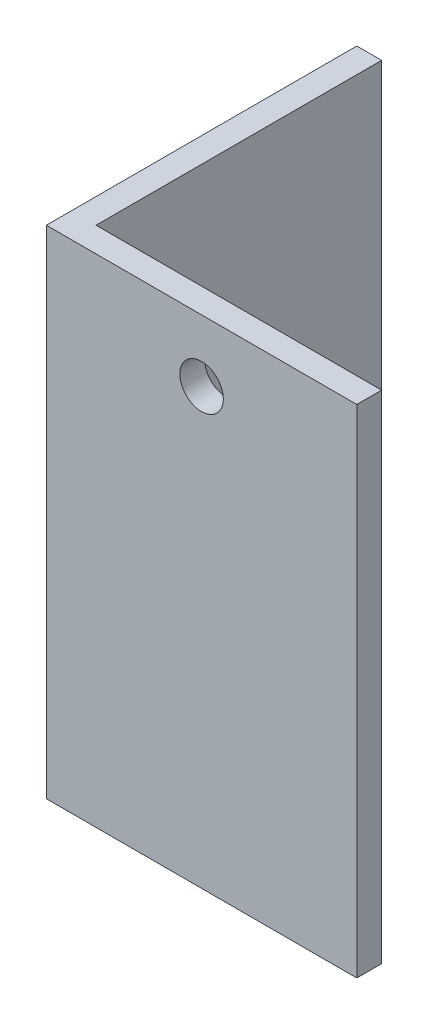
ISO-10303-21;
HEADER;
FILE_DESCRIPTION(('STEP AP214'),'2;1');
FILE_NAME('part.step','',(''),(''),'','','');
FILE_SCHEMA(('AUTOMOTIVE_DESIGN { 1 0 10303 214 1 1 1 1 }'));
ENDSEC;
DATA;
#1=APPLICATION_CONTEXT('core data for automotive mechanical design processes');
#2=APPLICATION_PROTOCOL_DEFINITION('international standard','automotive_design',2000,#1);
#3=PRODUCT_CONTEXT('',#1,'mechanical');
#4=PRODUCT('Part','Part','',(#3));
#5=PRODUCT_RELATED_PRODUCT_CATEGORY('part','',(#4));
#6=PRODUCT_DEFINITION_FORMATION('','',#4);
#7=PRODUCT_DEFINITION_CONTEXT('part definition',#1,'design');
#8=PRODUCT_DEFINITION('design','',#6,#7);
#9=PRODUCT_DEFINITION_SHAPE('','',#8);
#10=(LENGTH_UNIT() NAMED_UNIT(*) SI_UNIT(.MILLI.,.METRE.));
#11=(NAMED_UNIT(*) PLANE_ANGLE_UNIT() SI_UNIT($,.RADIAN.));
#12=(NAMED_UNIT(*) SI_UNIT($,.STERADIAN.) SOLID_ANGLE_UNIT());
#13=UNCERTAINTY_MEASURE_WITH_UNIT(LENGTH_MEASURE(1.E-05),#10,'distance_accuracy_value','');
#14=(GEOMETRIC_REPRESENTATION_CONTEXT(3) GLOBAL_UNCERTAINTY_ASSIGNED_CONTEXT((#13)) GLOBAL_UNIT_ASSIGNED_CONTEXT((#10,
#11,#12)) REPRESENTATION_CONTEXT('',''));
#15=CARTESIAN_POINT('',(0.,0.,0.));
#16=DIRECTION('',(0.,0.,1.));
#17=DIRECTION('',(1.,0.,0.));
#18=AXIS2_PLACEMENT_3D('',#15,#16,#17);
#19=CARTESIAN_POINT('',(0.,40.,0.));
#20=DIRECTION('',(1.,0.,0.));
#21=DIRECTION('',(0.,0.,-1.));
#22=AXIS2_PLACEMENT_3D('',#19,#20,#21);
#23=PLANE('',#22);
#24=CARTESIAN_POINT('',(0.,5.,-10.));
#25=DIRECTION('',(1.,0.,0.));
#26=DIRECTION('',(0.,0.,-1.));
#27=AXIS2_PLACEMENT_3D('',#24,#25,#26);
#28=CIRCLE('',#27,1.75);
#29=CARTESIAN_POINT('',(0.,5.,-11.75));
#30=VERTEX_POINT('',#29);
#31=EDGE_CURVE('E137',#30,#30,#28,.T.);
#32=ORIENTED_EDGE('',*,*,#31,.T.);
#33=EDGE_LOOP('',(#32));
#34=FACE_BOUND('',#33,.T.);
#35=DIRECTION('',(0.,0.,1.));
#36=VECTOR('',#35,1.);
#37=CARTESIAN_POINT('',(0.,0.,0.));
#38=LINE('',#37,#36);
#39=CARTESIAN_POINT('',(0.,0.,-25.));
#40=VERTEX_POINT('',#39);
#41=CARTESIAN_POINT('',(0.,0.,0.));
#42=VERTEX_POINT('',#41);
#43=EDGE_CURVE('E120',#40,#42,#38,.T.);
#44=ORIENTED_EDGE('',*,*,#43,.T.);
#45=DIRECTION('',(0.,-1.,0.));
#46=VECTOR('',#45,1.);
#47=CARTESIAN_POINT('',(0.,40.,0.));
#48=LINE('',#47,#46);
#49=CARTESIAN_POINT('',(0.,40.,0.));
#50=VERTEX_POINT('',#49);
#51=EDGE_CURVE('E11',#50,#42,#48,.T.);
#52=ORIENTED_EDGE('',*,*,#51,.F.);
#53=DIRECTION('',(0.,0.,1.));
#54=VECTOR('',#53,1.);
#55=CARTESIAN_POINT('',(0.,40.,0.));
#56=LINE('',#55,#54);
#57=CARTESIAN_POINT('',(0.,40.,-25.));
#58=VERTEX_POINT('',#57);
#59=EDGE_CURVE('E131',#58,#50,#56,.T.);
#60=ORIENTED_EDGE('',*,*,#59,.F.);
#61=DIRECTION('',(0.,-1.,0.));
#62=VECTOR('',#61,1.);
#63=CARTESIAN_POINT('',(0.,40.,-25.));
#64=LINE('',#63,#62);
#65=EDGE_CURVE('E116',#58,#40,#64,.T.);
#66=ORIENTED_EDGE('',*,*,#65,.T.);
#67=EDGE_LOOP('',(#44,#52,#60,#66));
#68=FACE_BOUND('',#67,.T.);
#69=ADVANCED_FACE('F34',(#34,#68),#23,.F.);
#70=CARTESIAN_POINT('',(0.,40.,0.));
#71=DIRECTION('',(0.,0.,-1.));
#72=DIRECTION('',(-1.,0.,0.));
#73=AXIS2_PLACEMENT_3D('',#70,#71,#72);
#74=PLANE('',#73);
#75=CARTESIAN_POINT('',(12.5,35.,0.));
#76=DIRECTION('',(0.,0.,-1.));
#77=DIRECTION('',(-1.,0.,0.));
#78=AXIS2_PLACEMENT_3D('',#75,#76,#77);
#79=CIRCLE('',#78,1.75);
#80=CARTESIAN_POINT('',(10.75,35.,0.));
#81=VERTEX_POINT('',#80);
#82=EDGE_CURVE('E145',#81,#81,#79,.T.);
#83=ORIENTED_EDGE('',*,*,#82,.T.);
#84=EDGE_LOOP('',(#83));
#85=FACE_BOUND('',#84,.T.);
#86=DIRECTION('',(1.,0.,0.));
#87=VECTOR('',#86,1.);
#88=CARTESIAN_POINT('',(0.,0.,0.));
#89=LINE('',#88,#87);
#90=CARTESIAN_POINT('',(25.,0.,0.));
#91=VERTEX_POINT('',#90);
#92=EDGE_CURVE('E123',#42,#91,#89,.T.);
#93=ORIENTED_EDGE('',*,*,#92,.T.);
#94=DIRECTION('',(0.,-1.,0.));
#95=VECTOR('',#94,1.);
#96=CARTESIAN_POINT('',(25.,40.,0.));
#97=LINE('',#96,#95);
#98=CARTESIAN_POINT('',(25.,40.,0.));
#99=VERTEX_POINT('',#98);
#100=EDGE_CURVE('E43',#99,#91,#97,.T.);
#101=ORIENTED_EDGE('',*,*,#100,.F.);
#102=DIRECTION('',(1.,0.,0.));
#103=VECTOR('',#102,1.);
#104=CARTESIAN_POINT('',(0.,40.,0.));
#105=LINE('',#104,#103);
#106=EDGE_CURVE('E89',#50,#99,#105,.T.);
#107=ORIENTED_EDGE('',*,*,#106,.F.);
#108=ORIENTED_EDGE('',*,*,#51,.T.);
#109=EDGE_LOOP('',(#93,#101,#107,#108));
#110=FACE_BOUND('',#109,.T.);
#111=ADVANCED_FACE('F151',(#85,#110),#74,.F.);
#112=CARTESIAN_POINT('',(25.,40.,0.));
#113=DIRECTION('',(-1.,0.,0.));
#114=DIRECTION('',(0.,0.,1.));
#115=AXIS2_PLACEMENT_3D('',#112,#113,#114);
#116=PLANE('',#115);
#117=DIRECTION('',(0.,0.,-1.));
#118=VECTOR('',#117,1.);
#119=CARTESIAN_POINT('',(25.,0.,0.));
#120=LINE('',#119,#118);
#121=CARTESIAN_POINT('',(25.,0.,-2.));
#122=VERTEX_POINT('',#121);
#123=EDGE_CURVE('E126',#91,#122,#120,.T.);
#124=ORIENTED_EDGE('',*,*,#123,.T.);
#125=DIRECTION('',(0.,-1.,0.));
#126=VECTOR('',#125,1.);
#127=CARTESIAN_POINT('',(25.,40.,-2.));
#128=LINE('',#127,#126);
#129=CARTESIAN_POINT('',(25.,40.,-2.));
#130=VERTEX_POINT('',#129);
#131=EDGE_CURVE('E111',#130,#122,#128,.T.);
#132=ORIENTED_EDGE('',*,*,#131,.F.);
#133=DIRECTION('',(0.,0.,-1.));
#134=VECTOR('',#133,1.);
#135=CARTESIAN_POINT('',(25.,40.,0.));
#136=LINE('',#135,#134);
#137=EDGE_CURVE('E102',#99,#130,#136,.T.);
#138=ORIENTED_EDGE('',*,*,#137,.F.);
#139=ORIENTED_EDGE('',*,*,#100,.T.);
#140=EDGE_LOOP('',(#124,#132,#138,#139));
#141=FACE_BOUND('',#140,.T.);
#142=ADVANCED_FACE('F154',(#141),#116,.F.);
#143=CARTESIAN_POINT('',(25.,40.,-2.));
#144=DIRECTION('',(0.,0.,1.));
#145=DIRECTION('',(1.,0.,0.));
#146=AXIS2_PLACEMENT_3D('',#143,#144,#145);
#147=PLANE('',#146);
#148=CARTESIAN_POINT('',(12.5,35.,-2.));
#149=DIRECTION('',(0.,0.,1.));
#150=DIRECTION('',(1.,0.,0.));
#151=AXIS2_PLACEMENT_3D('',#148,#149,#150);
#152=CIRCLE('',#151,1.75);
#153=CARTESIAN_POINT('',(14.25,35.,-2.));
#154=VERTEX_POINT('',#153);
#155=EDGE_CURVE('E37',#154,#154,#152,.F.);
#156=ORIENTED_EDGE('',*,*,#155,.F.);
#157=EDGE_LOOP('',(#156));
#158=FACE_BOUND('',#157,.T.);
#159=DIRECTION('',(-1.,0.,0.));
#160=VECTOR('',#159,1.);
#161=CARTESIAN_POINT('',(25.,0.,-2.));
#162=LINE('',#161,#160);
#163=CARTESIAN_POINT('',(2.00000000000001,0.,-2.));
#164=VERTEX_POINT('',#163);
#165=EDGE_CURVE('E110',#122,#164,#162,.T.);
#166=ORIENTED_EDGE('',*,*,#165,.T.);
#167=DIRECTION('',(0.,-1.,0.));
#168=VECTOR('',#167,1.);
#169=CARTESIAN_POINT('',(2.00000000000001,40.,-2.));
#170=LINE('',#169,#168);
#171=CARTESIAN_POINT('',(2.00000000000001,40.,-2.));
#172=VERTEX_POINT('',#171);
#173=EDGE_CURVE('E107',#172,#164,#170,.T.);
#174=ORIENTED_EDGE('',*,*,#173,.F.);
#175=DIRECTION('',(-1.,0.,0.));
#176=VECTOR('',#175,1.);
#177=CARTESIAN_POINT('',(25.,40.,-2.));
#178=LINE('',#177,#176);
#179=EDGE_CURVE('E96',#130,#172,#178,.T.);
#180=ORIENTED_EDGE('',*,*,#179,.F.);
#181=ORIENTED_EDGE('',*,*,#131,.T.);
#182=EDGE_LOOP('',(#166,#174,#180,#181));
#183=FACE_BOUND('',#182,.T.);
#184=ADVANCED_FACE('F108',(#158,#183),#147,.F.);
#185=CARTESIAN_POINT('',(2.,40.,-25.));
#186=DIRECTION('',(-1.,0.,0.));
#187=DIRECTION('',(0.,0.,1.));
#188=AXIS2_PLACEMENT_3D('',#185,#186,#187);
#189=PLANE('',#188);
#190=CARTESIAN_POINT('',(2.,5.,-10.));
#191=DIRECTION('',(-1.,0.,0.));
#192=DIRECTION('',(0.,0.,1.));
#193=AXIS2_PLACEMENT_3D('',#190,#191,#192);
#194=CIRCLE('',#193,1.75);
#195=CARTESIAN_POINT('',(2.,5.,-8.25));
#196=VERTEX_POINT('',#195);
#197=EDGE_CURVE('E124',#196,#196,#194,.F.);
#198=ORIENTED_EDGE('',*,*,#197,.F.);
#199=EDGE_LOOP('',(#198));
#200=FACE_BOUND('',#199,.T.);
#201=DIRECTION('',(0.,0.,-1.));
#202=VECTOR('',#201,1.);
#203=CARTESIAN_POINT('',(2.,0.,-25.));
#204=LINE('',#203,#202);
#205=CARTESIAN_POINT('',(2.,0.,-25.));
#206=VERTEX_POINT('',#205);
#207=EDGE_CURVE('E75',#164,#206,#204,.T.);
#208=ORIENTED_EDGE('',*,*,#207,.T.);
#209=DIRECTION('',(0.,-1.,0.));
#210=VECTOR('',#209,1.);
#211=CARTESIAN_POINT('',(2.,40.,-25.));
#212=LINE('',#211,#210);
#213=CARTESIAN_POINT('',(2.,40.,-25.));
#214=VERTEX_POINT('',#213);
#215=EDGE_CURVE('E112',#214,#206,#212,.T.);
#216=ORIENTED_EDGE('',*,*,#215,.F.);
#217=DIRECTION('',(0.,0.,-1.));
#218=VECTOR('',#217,1.);
#219=CARTESIAN_POINT('',(2.,40.,-25.));
#220=LINE('',#219,#218);
#221=EDGE_CURVE('E100',#172,#214,#220,.T.);
#222=ORIENTED_EDGE('',*,*,#221,.F.);
#223=ORIENTED_EDGE('',*,*,#173,.T.);
#224=EDGE_LOOP('',(#208,#216,#222,#223));
#225=FACE_BOUND('',#224,.T.);
#226=ADVANCED_FACE('F114',(#200,#225),#189,.F.);
#227=CARTESIAN_POINT('',(0.,40.,-25.));
#228=DIRECTION('',(0.,0.,1.));
#229=DIRECTION('',(1.,0.,0.));
#230=AXIS2_PLACEMENT_3D('',#227,#228,#229);
#231=PLANE('',#230);
#232=DIRECTION('',(-1.,0.,0.));
#233=VECTOR('',#232,1.);
#234=CARTESIAN_POINT('',(0.,0.,-25.));
#235=LINE('',#234,#233);
#236=EDGE_CURVE('E81',#206,#40,#235,.T.);
#237=ORIENTED_EDGE('',*,*,#236,.T.);
#238=ORIENTED_EDGE('',*,*,#65,.F.);
#239=DIRECTION('',(-1.,0.,0.));
#240=VECTOR('',#239,1.);
#241=CARTESIAN_POINT('',(0.,40.,-25.));
#242=LINE('',#241,#240);
#243=EDGE_CURVE('E52',#214,#58,#242,.T.);
#244=ORIENTED_EDGE('',*,*,#243,.F.);
#245=ORIENTED_EDGE('',*,*,#215,.T.);
#246=EDGE_LOOP('',(#237,#238,#244,#245));
#247=FACE_BOUND('',#246,.T.);
#248=ADVANCED_FACE('F159',(#247),#231,.F.);
#249=CARTESIAN_POINT('',(0.,40.,0.));
#250=DIRECTION('',(0.,-1.,0.));
#251=DIRECTION('',(0.,0.,-1.));
#252=AXIS2_PLACEMENT_3D('',#249,#250,#251);
#253=PLANE('',#252);
#254=ORIENTED_EDGE('',*,*,#59,.T.);
#255=ORIENTED_EDGE('',*,*,#106,.T.);
#256=ORIENTED_EDGE('',*,*,#137,.T.);
#257=ORIENTED_EDGE('',*,*,#179,.T.);
#258=ORIENTED_EDGE('',*,*,#221,.T.);
#259=ORIENTED_EDGE('',*,*,#243,.T.);
#260=EDGE_LOOP('',(#254,#255,#256,#257,#258,#259));
#261=FACE_BOUND('',#260,.T.);
#262=ADVANCED_FACE('F98',(#261),#253,.F.);
#263=CARTESIAN_POINT('',(0.,0.,0.));
#264=DIRECTION('',(0.,-1.,0.));
#265=DIRECTION('',(0.,0.,-1.));
#266=AXIS2_PLACEMENT_3D('',#263,#264,#265);
#267=PLANE('',#266);
#268=ORIENTED_EDGE('',*,*,#43,.F.);
#269=ORIENTED_EDGE('',*,*,#236,.F.);
#270=ORIENTED_EDGE('',*,*,#207,.F.);
#271=ORIENTED_EDGE('',*,*,#165,.F.);
#272=ORIENTED_EDGE('',*,*,#123,.F.);
#273=ORIENTED_EDGE('',*,*,#92,.F.);
#274=EDGE_LOOP('',(#268,#269,#270,#271,#272,#273));
#275=FACE_BOUND('',#274,.T.);
#276=ADVANCED_FACE('F157',(#275),#267,.T.);
#277=CARTESIAN_POINT('',(50.,5.,-10.));
#278=DIRECTION('',(-1.,0.,0.));
#279=DIRECTION('',(0.,0.,1.));
#280=AXIS2_PLACEMENT_3D('',#277,#278,#279);
#281=CYLINDRICAL_SURFACE('',#280,1.75);
#282=ORIENTED_EDGE('',*,*,#31,.F.);
#283=EDGE_LOOP('',(#282));
#284=FACE_BOUND('',#283,.T.);
#285=ORIENTED_EDGE('',*,*,#197,.T.);
#286=EDGE_LOOP('',(#285));
#287=FACE_BOUND('',#286,.T.);
#288=ADVANCED_FACE('F189',(#284,#287),#281,.F.);
#289=CARTESIAN_POINT('',(12.5,35.,-50.));
#290=DIRECTION('',(0.,0.,1.));
#291=DIRECTION('',(1.,0.,0.));
#292=AXIS2_PLACEMENT_3D('',#289,#290,#291);
#293=CYLINDRICAL_SURFACE('',#292,1.75);
#294=ORIENTED_EDGE('',*,*,#82,.F.);
#295=EDGE_LOOP('',(#294));
#296=FACE_BOUND('',#295,.T.);
#297=ORIENTED_EDGE('',*,*,#155,.T.);
#298=EDGE_LOOP('',(#297));
#299=FACE_BOUND('',#298,.T.);
#300=ADVANCED_FACE('F187',(#296,#299),#293,.F.);
#301=CLOSED_SHELL('',(#69,#111,#142,#184,#226,#248,#262,#276,#288,#300));
#302=MANIFOLD_SOLID_BREP('B2',#301);
#303=ADVANCED_BREP_SHAPE_REPRESENTATION('',(#18,#302),#14);
#304=SHAPE_DEFINITION_REPRESENTATION(#9,#303);
ENDSEC;
END-ISO-10303-21;
